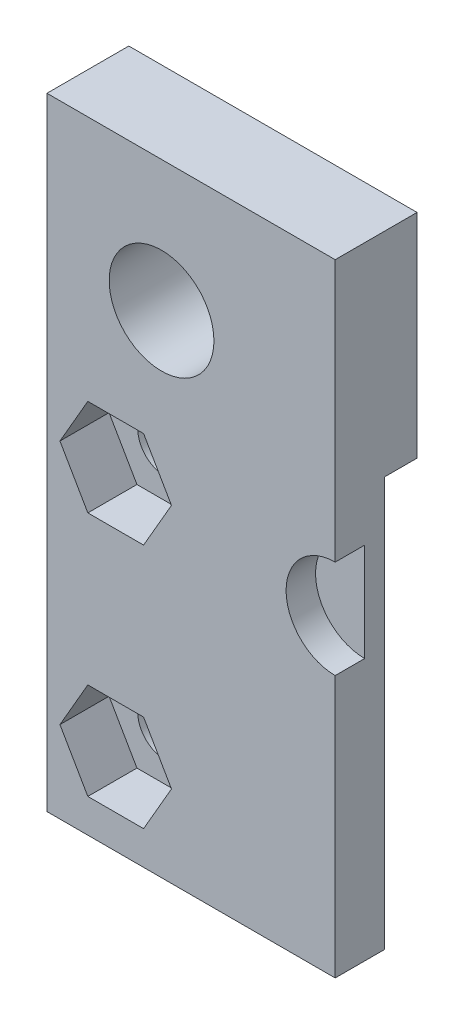
ISO-10303-21;
HEADER;
FILE_DESCRIPTION(('STEP AP214'),'2;1');
FILE_NAME('part.step','',(''),(''),'','','');
FILE_SCHEMA(('AUTOMOTIVE_DESIGN { 1 0 10303 214 1 1 1 1 }'));
ENDSEC;
DATA;
#1=APPLICATION_CONTEXT('core data for automotive mechanical design processes');
#2=APPLICATION_PROTOCOL_DEFINITION('international standard','automotive_design',2000,#1);
#3=PRODUCT_CONTEXT('',#1,'mechanical');
#4=PRODUCT('Part','Part','',(#3));
#5=PRODUCT_RELATED_PRODUCT_CATEGORY('part','',(#4));
#6=PRODUCT_DEFINITION_FORMATION('','',#4);
#7=PRODUCT_DEFINITION_CONTEXT('part definition',#1,'design');
#8=PRODUCT_DEFINITION('design','',#6,#7);
#9=PRODUCT_DEFINITION_SHAPE('','',#8);
#10=(LENGTH_UNIT() NAMED_UNIT(*) SI_UNIT(.MILLI.,.METRE.));
#11=(NAMED_UNIT(*) PLANE_ANGLE_UNIT() SI_UNIT($,.RADIAN.));
#12=(NAMED_UNIT(*) SI_UNIT($,.STERADIAN.) SOLID_ANGLE_UNIT());
#13=UNCERTAINTY_MEASURE_WITH_UNIT(LENGTH_MEASURE(1.E-05),#10,'distance_accuracy_value','');
#14=(GEOMETRIC_REPRESENTATION_CONTEXT(3) GLOBAL_UNCERTAINTY_ASSIGNED_CONTEXT((#13)) GLOBAL_UNIT_ASSIGNED_CONTEXT((#10,
#11,#12)) REPRESENTATION_CONTEXT('',''));
#15=CARTESIAN_POINT('',(0.,0.,0.));
#16=DIRECTION('',(0.,0.,1.));
#17=DIRECTION('',(1.,0.,0.));
#18=AXIS2_PLACEMENT_3D('',#15,#16,#17);
#19=CARTESIAN_POINT('',(0.,0.,5.));
#20=DIRECTION('',(0.,0.,-1.));
#21=DIRECTION('',(-1.,0.,0.));
#22=AXIS2_PLACEMENT_3D('',#19,#20,#21);
#23=PLANE('',#22);
#24=CARTESIAN_POINT('',(-2.41057900457741,5.83365910656025,5.));
#25=DIRECTION('',(0.,0.,1.));
#26=DIRECTION('',(1.,0.,0.));
#27=AXIS2_PLACEMENT_3D('',#24,#25,#26);
#28=CIRCLE('',#27,3.2);
#29=CARTESIAN_POINT('',(0.789420995422594,5.83365910656025,5.));
#30=VERTEX_POINT('',#29);
#31=EDGE_CURVE('E323',#30,#30,#28,.T.);
#32=ORIENTED_EDGE('',*,*,#31,.F.);
#33=EDGE_LOOP('',(#32));
#34=FACE_BOUND('',#33,.T.);
#35=DIRECTION('',(0.,1.,0.));
#36=VECTOR('',#35,1.);
#37=CARTESIAN_POINT('',(8.19602271322078,13.8336591065602,5.));
#38=LINE('',#37,#36);
#39=CARTESIAN_POINT('',(8.19602271322079,-24.1663408934398,5.));
#40=VERTEX_POINT('',#39);
#41=CARTESIAN_POINT('',(8.19602271322078,-8.16634089343975,5.));
#42=VERTEX_POINT('',#41);
#43=EDGE_CURVE('E337',#40,#42,#38,.T.);
#44=ORIENTED_EDGE('',*,*,#43,.T.);
#45=CARTESIAN_POINT('',(8.19602271322079,-5.16634089343975,5.));
#46=DIRECTION('',(0.,0.,1.));
#47=DIRECTION('',(1.,0.,0.));
#48=AXIS2_PLACEMENT_3D('',#45,#46,#47);
#49=CIRCLE('',#48,3.);
#50=CARTESIAN_POINT('',(8.19602271322079,-2.16634089343975,5.));
#51=VERTEX_POINT('',#50);
#52=EDGE_CURVE('E188',#51,#42,#49,.T.);
#53=ORIENTED_EDGE('',*,*,#52,.F.);
#54=CARTESIAN_POINT('',(8.19602271322078,13.8336591065602,5.));
#55=VERTEX_POINT('',#54);
#56=EDGE_CURVE('E193',#51,#55,#38,.T.);
#57=ORIENTED_EDGE('',*,*,#56,.T.);
#58=DIRECTION('',(-1.,0.,0.));
#59=VECTOR('',#58,1.);
#60=CARTESIAN_POINT('',(-9.41057900457741,13.8336591065602,5.));
#61=LINE('',#60,#59);
#62=CARTESIAN_POINT('',(-9.41057900457741,13.8336591065602,5.));
#63=VERTEX_POINT('',#62);
#64=EDGE_CURVE('E329',#55,#63,#61,.T.);
#65=ORIENTED_EDGE('',*,*,#64,.T.);
#66=DIRECTION('',(0.,-1.,0.));
#67=VECTOR('',#66,1.);
#68=CARTESIAN_POINT('',(-9.41057900457741,13.8336591065602,5.));
#69=LINE('',#68,#67);
#70=CARTESIAN_POINT('',(-9.4105790045774,-24.1663408934398,5.));
#71=VERTEX_POINT('',#70);
#72=EDGE_CURVE('E332',#63,#71,#69,.T.);
#73=ORIENTED_EDGE('',*,*,#72,.T.);
#74=DIRECTION('',(1.,0.,0.));
#75=VECTOR('',#74,1.);
#76=CARTESIAN_POINT('',(8.19602271322079,-24.1663408934398,5.));
#77=LINE('',#76,#75);
#78=EDGE_CURVE('E335',#71,#40,#77,.T.);
#79=ORIENTED_EDGE('',*,*,#78,.T.);
#80=EDGE_LOOP('',(#44,#53,#57,#65,#73,#79));
#81=FACE_BOUND('',#80,.T.);
#82=DIRECTION('',(-0.5,0.866025403784439,0.));
#83=VECTOR('',#82,1.);
#84=CARTESIAN_POINT('',(-3.15723783954135,-1.82283211655487,5.));
#85=LINE('',#84,#83);
#86=CARTESIAN_POINT('',(-1.80421241635861,-4.16634089343975,5.));
#87=VERTEX_POINT('',#86);
#88=CARTESIAN_POINT('',(-3.50739571046801,-1.21634089343975,5.));
#89=VERTEX_POINT('',#88);
#90=EDGE_CURVE('E196',#87,#89,#85,.T.);
#91=ORIENTED_EDGE('',*,*,#90,.F.);
#92=DIRECTION('',(0.5,0.866025403784439,0.));
#93=VECTOR('',#92,1.);
#94=CARTESIAN_POINT('',(0.450919215003431,-0.260338330165006,5.));
#95=LINE('',#94,#93);
#96=CARTESIAN_POINT('',(-3.50739571046801,-7.11634089343975,5.));
#97=VERTEX_POINT('',#96);
#98=EDGE_CURVE('E194',#97,#87,#95,.T.);
#99=ORIENTED_EDGE('',*,*,#98,.F.);
#100=DIRECTION('',(1.,0.,0.));
#101=VECTOR('',#100,1.);
#102=CARTESIAN_POINT('',(0.,-7.11634089343975,5.));
#103=LINE('',#102,#101);
#104=CARTESIAN_POINT('',(-6.9137622986868,-7.11634089343975,5.));
#105=VERTEX_POINT('',#104);
#106=EDGE_CURVE('E251',#105,#97,#103,.T.);
#107=ORIENTED_EDGE('',*,*,#106,.F.);
#108=DIRECTION('',(0.5,-0.866025403784439,0.));
#109=VECTOR('',#108,1.);
#110=CARTESIAN_POINT('',(-8.26678772186954,-4.77283211655487,5.));
#111=LINE('',#110,#109);
#112=CARTESIAN_POINT('',(-8.6169455927962,-4.16634089343975,5.));
#113=VERTEX_POINT('',#112);
#114=EDGE_CURVE('E278',#113,#105,#111,.T.);
#115=ORIENTED_EDGE('',*,*,#114,.F.);
#116=DIRECTION('',(-0.5,-0.866025403784438,0.));
#117=VECTOR('',#116,1.);
#118=CARTESIAN_POINT('',(-4.65863066732475,2.68966166983499,5.));
#119=LINE('',#118,#117);
#120=CARTESIAN_POINT('',(-6.9137622986868,-1.21634089343975,5.));
#121=VERTEX_POINT('',#120);
#122=EDGE_CURVE('E275',#121,#113,#119,.T.);
#123=ORIENTED_EDGE('',*,*,#122,.F.);
#124=DIRECTION('',(-1.,0.,0.));
#125=VECTOR('',#124,1.);
#126=CARTESIAN_POINT('',(0.,-1.21634089343975,5.));
#127=LINE('',#126,#125);
#128=EDGE_CURVE('E272',#89,#121,#127,.T.);
#129=ORIENTED_EDGE('',*,*,#128,.F.);
#130=EDGE_LOOP('',(#91,#99,#107,#115,#123,#129));
#131=FACE_BOUND('',#130,.T.);
#132=DIRECTION('',(-1.,0.,0.));
#133=VECTOR('',#132,1.);
#134=CARTESIAN_POINT('',(0.,-22.1163408934398,5.));
#135=LINE('',#134,#133);
#136=CARTESIAN_POINT('',(-3.507395710468,-22.1163408934398,5.));
#137=VERTEX_POINT('',#136);
#138=CARTESIAN_POINT('',(-6.91376229868679,-22.1163408934398,5.));
#139=VERTEX_POINT('',#138);
#140=EDGE_CURVE('E56',#137,#139,#135,.T.);
#141=ORIENTED_EDGE('',*,*,#140,.T.);
#142=DIRECTION('',(-0.5,0.866025403784439,0.));
#143=VECTOR('',#142,1.);
#144=CARTESIAN_POINT('',(-14.7619782502528,-8.52283211655487,5.));
#145=LINE('',#144,#143);
#146=CARTESIAN_POINT('',(-8.61694559279619,-19.1663408934397,5.));
#147=VERTEX_POINT('',#146);
#148=EDGE_CURVE('E205',#139,#147,#145,.T.);
#149=ORIENTED_EDGE('',*,*,#148,.T.);
#150=DIRECTION('',(0.5,0.866025403784439,0.));
#151=VECTOR('',#150,1.);
#152=CARTESIAN_POINT('',(1.83655986105853,-1.06033833016501,5.));
#153=LINE('',#152,#151);
#154=CARTESIAN_POINT('',(-6.9137622986868,-16.2163408934398,5.));
#155=VERTEX_POINT('',#154);
#156=EDGE_CURVE('E230',#147,#155,#153,.T.);
#157=ORIENTED_EDGE('',*,*,#156,.T.);
#158=DIRECTION('',(1.,0.,0.));
#159=VECTOR('',#158,1.);
#160=CARTESIAN_POINT('',(0.,-16.2163408934398,5.));
#161=LINE('',#160,#159);
#162=CARTESIAN_POINT('',(-3.507395710468,-16.2163408934398,5.));
#163=VERTEX_POINT('',#162);
#164=EDGE_CURVE('E227',#155,#163,#161,.T.);
#165=ORIENTED_EDGE('',*,*,#164,.T.);
#166=DIRECTION('',(0.5,-0.866025403784439,0.));
#167=VECTOR('',#166,1.);
#168=CARTESIAN_POINT('',(-9.65242836792464,-5.57283211655487,5.));
#169=LINE('',#168,#167);
#170=CARTESIAN_POINT('',(-1.80421241635861,-19.1663408934397,5.));
#171=VERTEX_POINT('',#170);
#172=EDGE_CURVE('E224',#163,#171,#169,.T.);
#173=ORIENTED_EDGE('',*,*,#172,.T.);
#174=DIRECTION('',(-0.5,-0.866025403784439,0.));
#175=VECTOR('',#174,1.);
#176=CARTESIAN_POINT('',(6.94610974338672,-4.010338330165,5.));
#177=LINE('',#176,#175);
#178=EDGE_CURVE('E220',#171,#137,#177,.T.);
#179=ORIENTED_EDGE('',*,*,#178,.T.);
#180=EDGE_LOOP('',(#141,#149,#157,#165,#173,#179));
#181=FACE_BOUND('',#180,.T.);
#182=ADVANCED_FACE('F34',(#34,#81,#131,#181),#23,.F.);
#183=CARTESIAN_POINT('',(-5.2105790045774,-4.16634089343975,5.));
#184=DIRECTION('',(0.,0.,-1.));
#185=DIRECTION('',(-1.,0.,0.));
#186=AXIS2_PLACEMENT_3D('',#183,#184,#185);
#187=CYLINDRICAL_SURFACE('',#186,1.65);
#188=CARTESIAN_POINT('',(-5.2105790045774,-4.16634089343975,0.));
#189=DIRECTION('',(0.,0.,1.));
#190=DIRECTION('',(1.,0.,0.));
#191=AXIS2_PLACEMENT_3D('',#188,#189,#190);
#192=CIRCLE('',#191,1.65);
#193=CARTESIAN_POINT('',(-3.5605790045774,-4.16634089343975,0.));
#194=VERTEX_POINT('',#193);
#195=EDGE_CURVE('E319',#194,#194,#192,.T.);
#196=ORIENTED_EDGE('',*,*,#195,.F.);
#197=EDGE_LOOP('',(#196));
#198=FACE_BOUND('',#197,.T.);
#199=CARTESIAN_POINT('',(-5.2105790045774,-4.16634089343975,2.));
#200=DIRECTION('',(0.,0.,1.));
#201=DIRECTION('',(1.,0.,0.));
#202=AXIS2_PLACEMENT_3D('',#199,#200,#201);
#203=CIRCLE('',#202,1.65);
#204=CARTESIAN_POINT('',(-3.5605790045774,-4.16634089343975,2.));
#205=VERTEX_POINT('',#204);
#206=EDGE_CURVE('E247',#205,#205,#203,.F.);
#207=ORIENTED_EDGE('',*,*,#206,.F.);
#208=EDGE_LOOP('',(#207));
#209=FACE_BOUND('',#208,.T.);
#210=ADVANCED_FACE('F397',(#198,#209),#187,.F.);
#211=CARTESIAN_POINT('',(-5.2105790045774,-19.1663408934397,5.));
#212=DIRECTION('',(0.,0.,-1.));
#213=DIRECTION('',(-1.,0.,0.));
#214=AXIS2_PLACEMENT_3D('',#211,#212,#213);
#215=CYLINDRICAL_SURFACE('',#214,1.65);
#216=CARTESIAN_POINT('',(-5.2105790045774,-19.1663408934397,0.));
#217=DIRECTION('',(0.,0.,1.));
#218=DIRECTION('',(-1.,0.,0.));
#219=AXIS2_PLACEMENT_3D('',#216,#217,#218);
#220=CIRCLE('',#219,1.65);
#221=CARTESIAN_POINT('',(-6.8605790045774,-19.1663408934397,0.));
#222=VERTEX_POINT('',#221);
#223=EDGE_CURVE('E312',#222,#222,#220,.T.);
#224=ORIENTED_EDGE('',*,*,#223,.F.);
#225=EDGE_LOOP('',(#224));
#226=FACE_BOUND('',#225,.T.);
#227=CARTESIAN_POINT('',(-5.2105790045774,-19.1663408934397,2.));
#228=DIRECTION('',(0.,0.,1.));
#229=DIRECTION('',(1.,0.,0.));
#230=AXIS2_PLACEMENT_3D('',#227,#228,#229);
#231=CIRCLE('',#230,1.65);
#232=CARTESIAN_POINT('',(-3.5605790045774,-19.1663408934397,2.));
#233=VERTEX_POINT('',#232);
#234=EDGE_CURVE('E215',#233,#233,#231,.F.);
#235=ORIENTED_EDGE('',*,*,#234,.F.);
#236=EDGE_LOOP('',(#235));
#237=FACE_BOUND('',#236,.T.);
#238=ADVANCED_FACE('F403',(#226,#237),#215,.F.);
#239=CARTESIAN_POINT('',(0.,0.,0.));
#240=DIRECTION('',(0.,0.,-1.));
#241=DIRECTION('',(-1.,0.,0.));
#242=AXIS2_PLACEMENT_3D('',#239,#240,#241);
#243=PLANE('',#242);
#244=DIRECTION('',(1.,0.,0.));
#245=VECTOR('',#244,1.);
#246=CARTESIAN_POINT('',(0.,0.833659106560258,0.));
#247=LINE('',#246,#245);
#248=CARTESIAN_POINT('',(4.19602271322078,0.833659106560255,0.));
#249=VERTEX_POINT('',#248);
#250=CARTESIAN_POINT('',(8.19602271322078,0.833659106560252,0.));
#251=VERTEX_POINT('',#250);
#252=EDGE_CURVE('E237',#249,#251,#247,.T.);
#253=ORIENTED_EDGE('',*,*,#252,.F.);
#254=DIRECTION('',(0.,1.,0.));
#255=VECTOR('',#254,1.);
#256=CARTESIAN_POINT('',(4.19602271322078,0.,0.));
#257=LINE('',#256,#255);
#258=CARTESIAN_POINT('',(4.19602271322079,-24.1663408934398,0.));
#259=VERTEX_POINT('',#258);
#260=EDGE_CURVE('E297',#259,#249,#257,.T.);
#261=ORIENTED_EDGE('',*,*,#260,.F.);
#262=DIRECTION('',(1.,0.,0.));
#263=VECTOR('',#262,1.);
#264=CARTESIAN_POINT('',(8.19602271322079,-24.1663408934398,0.));
#265=LINE('',#264,#263);
#266=CARTESIAN_POINT('',(-9.4105790045774,-24.1663408934398,0.));
#267=VERTEX_POINT('',#266);
#268=EDGE_CURVE('E345',#267,#259,#265,.T.);
#269=ORIENTED_EDGE('',*,*,#268,.F.);
#270=DIRECTION('',(0.,-1.,0.));
#271=VECTOR('',#270,1.);
#272=CARTESIAN_POINT('',(-9.41057900457741,13.8336591065602,0.));
#273=LINE('',#272,#271);
#274=CARTESIAN_POINT('',(-9.41057900457741,13.8336591065602,0.));
#275=VERTEX_POINT('',#274);
#276=EDGE_CURVE('E343',#275,#267,#273,.T.);
#277=ORIENTED_EDGE('',*,*,#276,.F.);
#278=DIRECTION('',(-1.,0.,0.));
#279=VECTOR('',#278,1.);
#280=CARTESIAN_POINT('',(-9.41057900457741,13.8336591065602,0.));
#281=LINE('',#280,#279);
#282=CARTESIAN_POINT('',(8.19602271322078,13.8336591065602,0.));
#283=VERTEX_POINT('',#282);
#284=EDGE_CURVE('E326',#283,#275,#281,.T.);
#285=ORIENTED_EDGE('',*,*,#284,.F.);
#286=DIRECTION('',(0.,1.,0.));
#287=VECTOR('',#286,1.);
#288=CARTESIAN_POINT('',(8.19602271322078,13.8336591065602,0.));
#289=LINE('',#288,#287);
#290=EDGE_CURVE('E333',#251,#283,#289,.T.);
#291=ORIENTED_EDGE('',*,*,#290,.F.);
#292=EDGE_LOOP('',(#253,#261,#269,#277,#285,#291));
#293=FACE_BOUND('',#292,.T.);
#294=ORIENTED_EDGE('',*,*,#195,.T.);
#295=EDGE_LOOP('',(#294));
#296=FACE_BOUND('',#295,.T.);
#297=CARTESIAN_POINT('',(-2.41057900457741,5.83365910656025,0.));
#298=DIRECTION('',(0.,0.,1.));
#299=DIRECTION('',(1.,0.,0.));
#300=AXIS2_PLACEMENT_3D('',#297,#298,#299);
#301=CIRCLE('',#300,3.2);
#302=CARTESIAN_POINT('',(0.789420995422594,5.83365910656025,0.));
#303=VERTEX_POINT('',#302);
#304=EDGE_CURVE('E322',#303,#303,#301,.T.);
#305=ORIENTED_EDGE('',*,*,#304,.T.);
#306=EDGE_LOOP('',(#305));
#307=FACE_BOUND('',#306,.T.);
#308=ORIENTED_EDGE('',*,*,#223,.T.);
#309=EDGE_LOOP('',(#308));
#310=FACE_BOUND('',#309,.T.);
#311=ADVANCED_FACE('F365',(#293,#296,#307,#310),#243,.T.);
#312=CARTESIAN_POINT('',(-9.41057900457741,13.8336591065602,5.));
#313=DIRECTION('',(0.,-1.,0.));
#314=DIRECTION('',(0.,0.,-1.));
#315=AXIS2_PLACEMENT_3D('',#312,#313,#314);
#316=PLANE('',#315);
#317=ORIENTED_EDGE('',*,*,#284,.T.);
#318=DIRECTION('',(0.,0.,-1.));
#319=VECTOR('',#318,1.);
#320=CARTESIAN_POINT('',(-9.41057900457741,13.8336591065602,5.));
#321=LINE('',#320,#319);
#322=EDGE_CURVE('E11',#63,#275,#321,.T.);
#323=ORIENTED_EDGE('',*,*,#322,.F.);
#324=ORIENTED_EDGE('',*,*,#64,.F.);
#325=DIRECTION('',(0.,0.,-1.));
#326=VECTOR('',#325,1.);
#327=CARTESIAN_POINT('',(8.19602271322078,13.8336591065602,5.));
#328=LINE('',#327,#326);
#329=EDGE_CURVE('E340',#55,#283,#328,.T.);
#330=ORIENTED_EDGE('',*,*,#329,.T.);
#331=EDGE_LOOP('',(#317,#323,#324,#330));
#332=FACE_BOUND('',#331,.T.);
#333=ADVANCED_FACE('F36',(#332),#316,.F.);
#334=CARTESIAN_POINT('',(-9.41057900457741,13.8336591065602,5.));
#335=DIRECTION('',(1.,0.,0.));
#336=DIRECTION('',(0.,1.,0.));
#337=AXIS2_PLACEMENT_3D('',#334,#335,#336);
#338=PLANE('',#337);
#339=ORIENTED_EDGE('',*,*,#276,.T.);
#340=DIRECTION('',(0.,0.,-1.));
#341=VECTOR('',#340,1.);
#342=CARTESIAN_POINT('',(-9.4105790045774,-24.1663408934398,5.));
#343=LINE('',#342,#341);
#344=EDGE_CURVE('E42',#71,#267,#343,.T.);
#345=ORIENTED_EDGE('',*,*,#344,.F.);
#346=ORIENTED_EDGE('',*,*,#72,.F.);
#347=ORIENTED_EDGE('',*,*,#322,.T.);
#348=EDGE_LOOP('',(#339,#345,#346,#347));
#349=FACE_BOUND('',#348,.T.);
#350=ADVANCED_FACE('F379',(#349),#338,.F.);
#351=CARTESIAN_POINT('',(8.19602271322079,-24.1663408934398,5.));
#352=DIRECTION('',(0.,1.,0.));
#353=DIRECTION('',(-1.,0.,0.));
#354=AXIS2_PLACEMENT_3D('',#351,#352,#353);
#355=PLANE('',#354);
#356=ORIENTED_EDGE('',*,*,#268,.T.);
#357=DIRECTION('',(0.,0.,-1.));
#358=VECTOR('',#357,1.);
#359=CARTESIAN_POINT('',(4.19602271322079,-24.1663408934398,2.));
#360=LINE('',#359,#358);
#361=CARTESIAN_POINT('',(4.19602271322079,-24.1663408934398,2.));
#362=VERTEX_POINT('',#361);
#363=EDGE_CURVE('E313',#362,#259,#360,.T.);
#364=ORIENTED_EDGE('',*,*,#363,.F.);
#365=DIRECTION('',(1.,0.,0.));
#366=VECTOR('',#365,1.);
#367=CARTESIAN_POINT('',(0.,-24.1663408934398,2.));
#368=LINE('',#367,#366);
#369=CARTESIAN_POINT('',(8.19602271322079,-24.1663408934398,2.));
#370=VERTEX_POINT('',#369);
#371=EDGE_CURVE('E300',#362,#370,#368,.T.);
#372=ORIENTED_EDGE('',*,*,#371,.T.);
#373=DIRECTION('',(0.,0.,-1.));
#374=VECTOR('',#373,1.);
#375=CARTESIAN_POINT('',(8.19602271322079,-24.1663408934398,5.));
#376=LINE('',#375,#374);
#377=EDGE_CURVE('E351',#40,#370,#376,.T.);
#378=ORIENTED_EDGE('',*,*,#377,.F.);
#379=ORIENTED_EDGE('',*,*,#78,.F.);
#380=ORIENTED_EDGE('',*,*,#344,.T.);
#381=EDGE_LOOP('',(#356,#364,#372,#378,#379,#380));
#382=FACE_BOUND('',#381,.T.);
#383=ADVANCED_FACE('F358',(#382),#355,.F.);
#384=CARTESIAN_POINT('',(8.19602271322078,13.8336591065602,5.));
#385=DIRECTION('',(-1.,0.,0.));
#386=DIRECTION('',(0.,-1.,0.));
#387=AXIS2_PLACEMENT_3D('',#384,#385,#386);
#388=PLANE('',#387);
#389=DIRECTION('',(0.,-1.,0.));
#390=VECTOR('',#389,1.);
#391=CARTESIAN_POINT('',(8.19602271322079,-2.16634089343975,3.2));
#392=LINE('',#391,#390);
#393=CARTESIAN_POINT('',(8.19602271322079,-2.16634089343975,3.2));
#394=VERTEX_POINT('',#393);
#395=CARTESIAN_POINT('',(8.19602271322078,-8.16634089343975,3.2));
#396=VERTEX_POINT('',#395);
#397=EDGE_CURVE('E177',#394,#396,#392,.T.);
#398=ORIENTED_EDGE('',*,*,#397,.T.);
#399=DIRECTION('',(0.,0.,1.));
#400=VECTOR('',#399,1.);
#401=CARTESIAN_POINT('',(8.19602271322078,-8.16634089343975,3.2));
#402=LINE('',#401,#400);
#403=EDGE_CURVE('E182',#396,#42,#402,.T.);
#404=ORIENTED_EDGE('',*,*,#403,.T.);
#405=ORIENTED_EDGE('',*,*,#43,.F.);
#406=ORIENTED_EDGE('',*,*,#377,.T.);
#407=DIRECTION('',(0.,1.,0.));
#408=VECTOR('',#407,1.);
#409=CARTESIAN_POINT('',(8.19602271322078,0.,2.));
#410=LINE('',#409,#408);
#411=CARTESIAN_POINT('',(8.19602271322078,0.833659106560256,2.));
#412=VERTEX_POINT('',#411);
#413=EDGE_CURVE('E296',#370,#412,#410,.T.);
#414=ORIENTED_EDGE('',*,*,#413,.T.);
#415=DIRECTION('',(0.,0.,-1.));
#416=VECTOR('',#415,1.);
#417=CARTESIAN_POINT('',(8.19602271322078,0.833659106560252,2.));
#418=LINE('',#417,#416);
#419=EDGE_CURVE('E306',#412,#251,#418,.T.);
#420=ORIENTED_EDGE('',*,*,#419,.T.);
#421=ORIENTED_EDGE('',*,*,#290,.T.);
#422=ORIENTED_EDGE('',*,*,#329,.F.);
#423=ORIENTED_EDGE('',*,*,#56,.F.);
#424=DIRECTION('',(0.,0.,1.));
#425=VECTOR('',#424,1.);
#426=CARTESIAN_POINT('',(8.19602271322079,-2.16634089343975,3.2));
#427=LINE('',#426,#425);
#428=EDGE_CURVE('E186',#394,#51,#427,.T.);
#429=ORIENTED_EDGE('',*,*,#428,.F.);
#430=EDGE_LOOP('',(#398,#404,#405,#406,#414,#420,#421,#422,#423,#429));
#431=FACE_BOUND('',#430,.T.);
#432=ADVANCED_FACE('F191',(#431),#388,.F.);
#433=CARTESIAN_POINT('',(-2.41057900457741,5.83365910656025,5.));
#434=DIRECTION('',(0.,0.,-1.));
#435=DIRECTION('',(-1.,0.,0.));
#436=AXIS2_PLACEMENT_3D('',#433,#434,#435);
#437=CYLINDRICAL_SURFACE('',#436,3.2);
#438=ORIENTED_EDGE('',*,*,#31,.T.);
#439=EDGE_LOOP('',(#438));
#440=FACE_BOUND('',#439,.T.);
#441=ORIENTED_EDGE('',*,*,#304,.F.);
#442=EDGE_LOOP('',(#441));
#443=FACE_BOUND('',#442,.T.);
#444=ADVANCED_FACE('F409',(#440,#443),#437,.F.);
#445=CARTESIAN_POINT('',(0.,0.833659106560258,2.));
#446=DIRECTION('',(0.,1.,0.));
#447=DIRECTION('',(-1.,0.,0.));
#448=AXIS2_PLACEMENT_3D('',#445,#446,#447);
#449=PLANE('',#448);
#450=ORIENTED_EDGE('',*,*,#252,.T.);
#451=ORIENTED_EDGE('',*,*,#419,.F.);
#452=DIRECTION('',(1.,0.,0.));
#453=VECTOR('',#452,1.);
#454=CARTESIAN_POINT('',(0.,0.833659106560258,2.));
#455=LINE('',#454,#453);
#456=CARTESIAN_POINT('',(4.19602271322078,0.833659106560255,2.));
#457=VERTEX_POINT('',#456);
#458=EDGE_CURVE('E294',#457,#412,#455,.T.);
#459=ORIENTED_EDGE('',*,*,#458,.F.);
#460=DIRECTION('',(0.,0.,-1.));
#461=VECTOR('',#460,1.);
#462=CARTESIAN_POINT('',(4.19602271322078,0.833659106560255,2.));
#463=LINE('',#462,#461);
#464=EDGE_CURVE('E310',#457,#249,#463,.T.);
#465=ORIENTED_EDGE('',*,*,#464,.T.);
#466=EDGE_LOOP('',(#450,#451,#459,#465));
#467=FACE_BOUND('',#466,.T.);
#468=ADVANCED_FACE('F383',(#467),#449,.F.);
#469=CARTESIAN_POINT('',(4.19602271322078,0.,2.));
#470=DIRECTION('',(-1.,0.,0.));
#471=DIRECTION('',(0.,-1.,0.));
#472=AXIS2_PLACEMENT_3D('',#469,#470,#471);
#473=PLANE('',#472);
#474=ORIENTED_EDGE('',*,*,#260,.T.);
#475=ORIENTED_EDGE('',*,*,#464,.F.);
#476=DIRECTION('',(0.,1.,0.));
#477=VECTOR('',#476,1.);
#478=CARTESIAN_POINT('',(4.19602271322078,0.,2.));
#479=LINE('',#478,#477);
#480=EDGE_CURVE('E303',#362,#457,#479,.T.);
#481=ORIENTED_EDGE('',*,*,#480,.F.);
#482=ORIENTED_EDGE('',*,*,#363,.T.);
#483=EDGE_LOOP('',(#474,#475,#481,#482));
#484=FACE_BOUND('',#483,.T.);
#485=ADVANCED_FACE('F370',(#484),#473,.F.);
#486=CARTESIAN_POINT('',(0.,0.,2.));
#487=DIRECTION('',(0.,0.,1.));
#488=DIRECTION('',(1.,0.,0.));
#489=AXIS2_PLACEMENT_3D('',#486,#487,#488);
#490=PLANE('',#489);
#491=ORIENTED_EDGE('',*,*,#458,.T.);
#492=ORIENTED_EDGE('',*,*,#413,.F.);
#493=ORIENTED_EDGE('',*,*,#371,.F.);
#494=ORIENTED_EDGE('',*,*,#480,.T.);
#495=EDGE_LOOP('',(#491,#492,#493,#494));
#496=FACE_BOUND('',#495,.T.);
#497=ADVANCED_FACE('F384',(#496),#490,.F.);
#498=CARTESIAN_POINT('',(0.,-22.1163408934398,2.));
#499=DIRECTION('',(0.,1.,0.));
#500=DIRECTION('',(0.,0.,1.));
#501=AXIS2_PLACEMENT_3D('',#498,#499,#500);
#502=PLANE('',#501);
#503=ORIENTED_EDGE('',*,*,#140,.F.);
#504=DIRECTION('',(0.,0.,1.));
#505=VECTOR('',#504,1.);
#506=CARTESIAN_POINT('',(-3.507395710468,-22.1163408934398,2.));
#507=LINE('',#506,#505);
#508=CARTESIAN_POINT('',(-3.507395710468,-22.1163408934398,2.));
#509=VERTEX_POINT('',#508);
#510=EDGE_CURVE('E218',#509,#137,#507,.T.);
#511=ORIENTED_EDGE('',*,*,#510,.F.);
#512=DIRECTION('',(-1.,0.,0.));
#513=VECTOR('',#512,1.);
#514=CARTESIAN_POINT('',(0.,-22.1163408934398,2.));
#515=LINE('',#514,#513);
#516=CARTESIAN_POINT('',(-6.91376229868679,-22.1163408934398,2.));
#517=VERTEX_POINT('',#516);
#518=EDGE_CURVE('E201',#509,#517,#515,.T.);
#519=ORIENTED_EDGE('',*,*,#518,.T.);
#520=DIRECTION('',(0.,0.,1.));
#521=VECTOR('',#520,1.);
#522=CARTESIAN_POINT('',(-6.91376229868679,-22.1163408934398,2.));
#523=LINE('',#522,#521);
#524=EDGE_CURVE('E235',#517,#139,#523,.T.);
#525=ORIENTED_EDGE('',*,*,#524,.T.);
#526=EDGE_LOOP('',(#503,#511,#519,#525));
#527=FACE_BOUND('',#526,.T.);
#528=ADVANCED_FACE('F386',(#527),#502,.T.);
#529=CARTESIAN_POINT('',(-14.7619782502528,-8.52283211655487,2.));
#530=DIRECTION('',(0.866025403784439,0.5,0.));
#531=DIRECTION('',(-0.5,0.866025403784439,0.));
#532=AXIS2_PLACEMENT_3D('',#529,#530,#531);
#533=PLANE('',#532);
#534=ORIENTED_EDGE('',*,*,#148,.F.);
#535=ORIENTED_EDGE('',*,*,#524,.F.);
#536=DIRECTION('',(-0.5,0.866025403784439,0.));
#537=VECTOR('',#536,1.);
#538=CARTESIAN_POINT('',(-14.7619782502528,-8.52283211655487,2.));
#539=LINE('',#538,#537);
#540=CARTESIAN_POINT('',(-8.61694559279619,-19.1663408934397,2.));
#541=VERTEX_POINT('',#540);
#542=EDGE_CURVE('E213',#517,#541,#539,.T.);
#543=ORIENTED_EDGE('',*,*,#542,.T.);
#544=DIRECTION('',(0.,0.,1.));
#545=VECTOR('',#544,1.);
#546=CARTESIAN_POINT('',(-8.61694559279619,-19.1663408934397,2.));
#547=LINE('',#546,#545);
#548=EDGE_CURVE('E238',#541,#147,#547,.T.);
#549=ORIENTED_EDGE('',*,*,#548,.T.);
#550=EDGE_LOOP('',(#534,#535,#543,#549));
#551=FACE_BOUND('',#550,.T.);
#552=ADVANCED_FACE('F392',(#551),#533,.T.);
#553=CARTESIAN_POINT('',(1.83655986105853,-1.06033833016501,2.));
#554=DIRECTION('',(0.866025403784439,-0.5,0.));
#555=DIRECTION('',(0.5,0.866025403784439,0.));
#556=AXIS2_PLACEMENT_3D('',#553,#554,#555);
#557=PLANE('',#556);
#558=ORIENTED_EDGE('',*,*,#156,.F.);
#559=ORIENTED_EDGE('',*,*,#548,.F.);
#560=DIRECTION('',(0.5,0.866025403784439,0.));
#561=VECTOR('',#560,1.);
#562=CARTESIAN_POINT('',(1.83655986105853,-1.06033833016501,2.));
#563=LINE('',#562,#561);
#564=CARTESIAN_POINT('',(-6.9137622986868,-16.2163408934398,2.));
#565=VERTEX_POINT('',#564);
#566=EDGE_CURVE('E211',#541,#565,#563,.T.);
#567=ORIENTED_EDGE('',*,*,#566,.T.);
#568=DIRECTION('',(0.,0.,1.));
#569=VECTOR('',#568,1.);
#570=CARTESIAN_POINT('',(-6.9137622986868,-16.2163408934398,2.));
#571=LINE('',#570,#569);
#572=EDGE_CURVE('E240',#565,#155,#571,.T.);
#573=ORIENTED_EDGE('',*,*,#572,.T.);
#574=EDGE_LOOP('',(#558,#559,#567,#573));
#575=FACE_BOUND('',#574,.T.);
#576=ADVANCED_FACE('F518',(#575),#557,.T.);
#577=CARTESIAN_POINT('',(0.,-16.2163408934398,2.));
#578=DIRECTION('',(0.,-1.,0.));
#579=DIRECTION('',(0.,0.,-1.));
#580=AXIS2_PLACEMENT_3D('',#577,#578,#579);
#581=PLANE('',#580);
#582=ORIENTED_EDGE('',*,*,#164,.F.);
#583=ORIENTED_EDGE('',*,*,#572,.F.);
#584=DIRECTION('',(1.,0.,0.));
#585=VECTOR('',#584,1.);
#586=CARTESIAN_POINT('',(0.,-16.2163408934398,2.));
#587=LINE('',#586,#585);
#588=CARTESIAN_POINT('',(-3.507395710468,-16.2163408934398,2.));
#589=VERTEX_POINT('',#588);
#590=EDGE_CURVE('E209',#565,#589,#587,.T.);
#591=ORIENTED_EDGE('',*,*,#590,.T.);
#592=DIRECTION('',(0.,0.,1.));
#593=VECTOR('',#592,1.);
#594=CARTESIAN_POINT('',(-3.507395710468,-16.2163408934398,2.));
#595=LINE('',#594,#593);
#596=EDGE_CURVE('E242',#589,#163,#595,.T.);
#597=ORIENTED_EDGE('',*,*,#596,.T.);
#598=EDGE_LOOP('',(#582,#583,#591,#597));
#599=FACE_BOUND('',#598,.T.);
#600=ADVANCED_FACE('F522',(#599),#581,.T.);
#601=CARTESIAN_POINT('',(-9.65242836792464,-5.57283211655487,2.));
#602=DIRECTION('',(-0.866025403784438,-0.5,0.));
#603=DIRECTION('',(0.5,-0.866025403784439,0.));
#604=AXIS2_PLACEMENT_3D('',#601,#602,#603);
#605=PLANE('',#604);
#606=ORIENTED_EDGE('',*,*,#172,.F.);
#607=ORIENTED_EDGE('',*,*,#596,.F.);
#608=DIRECTION('',(0.5,-0.866025403784439,0.));
#609=VECTOR('',#608,1.);
#610=CARTESIAN_POINT('',(-9.65242836792464,-5.57283211655487,2.));
#611=LINE('',#610,#609);
#612=CARTESIAN_POINT('',(-1.80421241635861,-19.1663408934397,2.));
#613=VERTEX_POINT('',#612);
#614=EDGE_CURVE('E207',#589,#613,#611,.T.);
#615=ORIENTED_EDGE('',*,*,#614,.T.);
#616=DIRECTION('',(0.,0.,1.));
#617=VECTOR('',#616,1.);
#618=CARTESIAN_POINT('',(-1.80421241635861,-19.1663408934397,2.));
#619=LINE('',#618,#617);
#620=EDGE_CURVE('E244',#613,#171,#619,.T.);
#621=ORIENTED_EDGE('',*,*,#620,.T.);
#622=EDGE_LOOP('',(#606,#607,#615,#621));
#623=FACE_BOUND('',#622,.T.);
#624=ADVANCED_FACE('F509',(#623),#605,.T.);
#625=CARTESIAN_POINT('',(6.94610974338672,-4.010338330165,2.));
#626=DIRECTION('',(-0.866025403784439,0.5,0.));
#627=DIRECTION('',(-0.5,-0.866025403784439,0.));
#628=AXIS2_PLACEMENT_3D('',#625,#626,#627);
#629=PLANE('',#628);
#630=ORIENTED_EDGE('',*,*,#178,.F.);
#631=ORIENTED_EDGE('',*,*,#620,.F.);
#632=DIRECTION('',(-0.5,-0.866025403784439,0.));
#633=VECTOR('',#632,1.);
#634=CARTESIAN_POINT('',(6.94610974338672,-4.010338330165,2.));
#635=LINE('',#634,#633);
#636=EDGE_CURVE('E204',#613,#509,#635,.T.);
#637=ORIENTED_EDGE('',*,*,#636,.T.);
#638=ORIENTED_EDGE('',*,*,#510,.T.);
#639=EDGE_LOOP('',(#630,#631,#637,#638));
#640=FACE_BOUND('',#639,.T.);
#641=ADVANCED_FACE('F500',(#640),#629,.T.);
#642=CARTESIAN_POINT('',(0.,0.,2.));
#643=DIRECTION('',(0.,0.,1.));
#644=DIRECTION('',(1.,0.,0.));
#645=AXIS2_PLACEMENT_3D('',#642,#643,#644);
#646=PLANE('',#645);
#647=ORIENTED_EDGE('',*,*,#518,.F.);
#648=ORIENTED_EDGE('',*,*,#636,.F.);
#649=ORIENTED_EDGE('',*,*,#614,.F.);
#650=ORIENTED_EDGE('',*,*,#590,.F.);
#651=ORIENTED_EDGE('',*,*,#566,.F.);
#652=ORIENTED_EDGE('',*,*,#542,.F.);
#653=EDGE_LOOP('',(#647,#648,#649,#650,#651,#652));
#654=FACE_BOUND('',#653,.T.);
#655=ORIENTED_EDGE('',*,*,#234,.T.);
#656=EDGE_LOOP('',(#655));
#657=FACE_BOUND('',#656,.T.);
#658=ADVANCED_FACE('F497',(#654,#657),#646,.T.);
#659=CARTESIAN_POINT('',(0.450919215003431,-0.260338330165006,2.));
#660=DIRECTION('',(0.866025403784438,-0.5,0.));
#661=DIRECTION('',(0.5,0.866025403784439,0.));
#662=AXIS2_PLACEMENT_3D('',#659,#660,#661);
#663=PLANE('',#662);
#664=ORIENTED_EDGE('',*,*,#98,.T.);
#665=DIRECTION('',(0.,0.,1.));
#666=VECTOR('',#665,1.);
#667=CARTESIAN_POINT('',(-1.80421241635861,-4.16634089343975,2.));
#668=LINE('',#667,#666);
#669=CARTESIAN_POINT('',(-1.80421241635861,-4.16634089343975,2.));
#670=VERTEX_POINT('',#669);
#671=EDGE_CURVE('E268',#670,#87,#668,.T.);
#672=ORIENTED_EDGE('',*,*,#671,.F.);
#673=DIRECTION('',(0.5,0.866025403784439,0.));
#674=VECTOR('',#673,1.);
#675=CARTESIAN_POINT('',(0.450919215003431,-0.260338330165006,2.));
#676=LINE('',#675,#674);
#677=CARTESIAN_POINT('',(-3.50739571046801,-7.11634089343975,2.));
#678=VERTEX_POINT('',#677);
#679=EDGE_CURVE('E250',#678,#670,#676,.T.);
#680=ORIENTED_EDGE('',*,*,#679,.F.);
#681=DIRECTION('',(0.,0.,1.));
#682=VECTOR('',#681,1.);
#683=CARTESIAN_POINT('',(-3.50739571046801,-7.11634089343975,2.));
#684=LINE('',#683,#682);
#685=EDGE_CURVE('E221',#678,#97,#684,.T.);
#686=ORIENTED_EDGE('',*,*,#685,.T.);
#687=EDGE_LOOP('',(#664,#672,#680,#686));
#688=FACE_BOUND('',#687,.T.);
#689=ADVANCED_FACE('F499',(#688),#663,.F.);
#690=CARTESIAN_POINT('',(0.,-7.11634089343975,2.));
#691=DIRECTION('',(0.,-1.,0.));
#692=DIRECTION('',(0.,0.,-1.));
#693=AXIS2_PLACEMENT_3D('',#690,#691,#692);
#694=PLANE('',#693);
#695=ORIENTED_EDGE('',*,*,#106,.T.);
#696=ORIENTED_EDGE('',*,*,#685,.F.);
#697=DIRECTION('',(1.,0.,0.));
#698=VECTOR('',#697,1.);
#699=CARTESIAN_POINT('',(0.,-7.11634089343975,2.));
#700=LINE('',#699,#698);
#701=CARTESIAN_POINT('',(-6.9137622986868,-7.11634089343975,2.));
#702=VERTEX_POINT('',#701);
#703=EDGE_CURVE('E266',#702,#678,#700,.T.);
#704=ORIENTED_EDGE('',*,*,#703,.F.);
#705=DIRECTION('',(0.,0.,1.));
#706=VECTOR('',#705,1.);
#707=CARTESIAN_POINT('',(-6.9137622986868,-7.11634089343975,2.));
#708=LINE('',#707,#706);
#709=EDGE_CURVE('E284',#702,#105,#708,.T.);
#710=ORIENTED_EDGE('',*,*,#709,.T.);
#711=EDGE_LOOP('',(#695,#696,#704,#710));
#712=FACE_BOUND('',#711,.T.);
#713=ADVANCED_FACE('F507',(#712),#694,.F.);
#714=CARTESIAN_POINT('',(-8.26678772186954,-4.77283211655487,2.));
#715=DIRECTION('',(-0.866025403784438,-0.5,0.));
#716=DIRECTION('',(0.5,-0.866025403784439,0.));
#717=AXIS2_PLACEMENT_3D('',#714,#715,#716);
#718=PLANE('',#717);
#719=ORIENTED_EDGE('',*,*,#114,.T.);
#720=ORIENTED_EDGE('',*,*,#709,.F.);
#721=DIRECTION('',(0.5,-0.866025403784439,0.));
#722=VECTOR('',#721,1.);
#723=CARTESIAN_POINT('',(-8.26678772186954,-4.77283211655487,2.));
#724=LINE('',#723,#722);
#725=CARTESIAN_POINT('',(-8.6169455927962,-4.16634089343975,2.));
#726=VERTEX_POINT('',#725);
#727=EDGE_CURVE('E263',#726,#702,#724,.T.);
#728=ORIENTED_EDGE('',*,*,#727,.F.);
#729=DIRECTION('',(0.,0.,1.));
#730=VECTOR('',#729,1.);
#731=CARTESIAN_POINT('',(-8.6169455927962,-4.16634089343975,2.));
#732=LINE('',#731,#730);
#733=EDGE_CURVE('E286',#726,#113,#732,.T.);
#734=ORIENTED_EDGE('',*,*,#733,.T.);
#735=EDGE_LOOP('',(#719,#720,#728,#734));
#736=FACE_BOUND('',#735,.T.);
#737=ADVANCED_FACE('F537',(#736),#718,.F.);
#738=CARTESIAN_POINT('',(-4.65863066732475,2.68966166983499,2.));
#739=DIRECTION('',(-0.866025403784438,0.500000000000001,0.));
#740=DIRECTION('',(-0.500000000000001,-0.866025403784438,0.));
#741=AXIS2_PLACEMENT_3D('',#738,#739,#740);
#742=PLANE('',#741);
#743=ORIENTED_EDGE('',*,*,#122,.T.);
#744=ORIENTED_EDGE('',*,*,#733,.F.);
#745=DIRECTION('',(-0.5,-0.866025403784438,0.));
#746=VECTOR('',#745,1.);
#747=CARTESIAN_POINT('',(-4.65863066732475,2.68966166983499,2.));
#748=LINE('',#747,#746);
#749=CARTESIAN_POINT('',(-6.9137622986868,-1.21634089343975,2.));
#750=VERTEX_POINT('',#749);
#751=EDGE_CURVE('E260',#750,#726,#748,.T.);
#752=ORIENTED_EDGE('',*,*,#751,.F.);
#753=DIRECTION('',(0.,0.,1.));
#754=VECTOR('',#753,1.);
#755=CARTESIAN_POINT('',(-6.9137622986868,-1.21634089343975,2.));
#756=LINE('',#755,#754);
#757=EDGE_CURVE('E288',#750,#121,#756,.T.);
#758=ORIENTED_EDGE('',*,*,#757,.T.);
#759=EDGE_LOOP('',(#743,#744,#752,#758));
#760=FACE_BOUND('',#759,.T.);
#761=ADVANCED_FACE('F541',(#760),#742,.F.);
#762=CARTESIAN_POINT('',(0.,-1.21634089343975,2.));
#763=DIRECTION('',(0.,1.,0.));
#764=DIRECTION('',(-1.,0.,0.));
#765=AXIS2_PLACEMENT_3D('',#762,#763,#764);
#766=PLANE('',#765);
#767=ORIENTED_EDGE('',*,*,#128,.T.);
#768=ORIENTED_EDGE('',*,*,#757,.F.);
#769=DIRECTION('',(-1.,0.,0.));
#770=VECTOR('',#769,1.);
#771=CARTESIAN_POINT('',(0.,-1.21634089343975,2.));
#772=LINE('',#771,#770);
#773=CARTESIAN_POINT('',(-3.50739571046801,-1.21634089343975,2.));
#774=VERTEX_POINT('',#773);
#775=EDGE_CURVE('E257',#774,#750,#772,.T.);
#776=ORIENTED_EDGE('',*,*,#775,.F.);
#777=DIRECTION('',(0.,0.,1.));
#778=VECTOR('',#777,1.);
#779=CARTESIAN_POINT('',(-3.50739571046801,-1.21634089343975,2.));
#780=LINE('',#779,#778);
#781=EDGE_CURVE('E290',#774,#89,#780,.T.);
#782=ORIENTED_EDGE('',*,*,#781,.T.);
#783=EDGE_LOOP('',(#767,#768,#776,#782));
#784=FACE_BOUND('',#783,.T.);
#785=ADVANCED_FACE('F545',(#784),#766,.F.);
#786=CARTESIAN_POINT('',(-3.15723783954135,-1.82283211655487,2.));
#787=DIRECTION('',(0.866025403784439,0.5,0.));
#788=DIRECTION('',(-0.5,0.866025403784439,0.));
#789=AXIS2_PLACEMENT_3D('',#786,#787,#788);
#790=PLANE('',#789);
#791=ORIENTED_EDGE('',*,*,#90,.T.);
#792=ORIENTED_EDGE('',*,*,#781,.F.);
#793=DIRECTION('',(-0.5,0.866025403784439,0.));
#794=VECTOR('',#793,1.);
#795=CARTESIAN_POINT('',(-3.15723783954135,-1.82283211655487,2.));
#796=LINE('',#795,#794);
#797=EDGE_CURVE('E254',#670,#774,#796,.T.);
#798=ORIENTED_EDGE('',*,*,#797,.F.);
#799=ORIENTED_EDGE('',*,*,#671,.T.);
#800=EDGE_LOOP('',(#791,#792,#798,#799));
#801=FACE_BOUND('',#800,.T.);
#802=ADVANCED_FACE('F533',(#801),#790,.F.);
#803=CARTESIAN_POINT('',(0.,0.,2.));
#804=DIRECTION('',(0.,0.,1.));
#805=DIRECTION('',(1.,0.,0.));
#806=AXIS2_PLACEMENT_3D('',#803,#804,#805);
#807=PLANE('',#806);
#808=ORIENTED_EDGE('',*,*,#206,.T.);
#809=EDGE_LOOP('',(#808));
#810=FACE_BOUND('',#809,.T.);
#811=ORIENTED_EDGE('',*,*,#679,.T.);
#812=ORIENTED_EDGE('',*,*,#797,.T.);
#813=ORIENTED_EDGE('',*,*,#775,.T.);
#814=ORIENTED_EDGE('',*,*,#751,.T.);
#815=ORIENTED_EDGE('',*,*,#727,.T.);
#816=ORIENTED_EDGE('',*,*,#703,.T.);
#817=EDGE_LOOP('',(#811,#812,#813,#814,#815,#816));
#818=FACE_BOUND('',#817,.T.);
#819=ADVANCED_FACE('F530',(#810,#818),#807,.T.);
#820=CARTESIAN_POINT('',(8.19602271322079,-5.16634089343975,3.2));
#821=DIRECTION('',(0.,0.,1.));
#822=DIRECTION('',(1.,0.,0.));
#823=AXIS2_PLACEMENT_3D('',#820,#821,#822);
#824=CYLINDRICAL_SURFACE('',#823,3.);
#825=ORIENTED_EDGE('',*,*,#52,.T.);
#826=ORIENTED_EDGE('',*,*,#403,.F.);
#827=CARTESIAN_POINT('',(8.19602271322079,-5.16634089343975,3.2));
#828=DIRECTION('',(0.,0.,1.));
#829=DIRECTION('',(1.,0.,0.));
#830=AXIS2_PLACEMENT_3D('',#827,#828,#829);
#831=CIRCLE('',#830,3.);
#832=EDGE_CURVE('E48',#394,#396,#831,.T.);
#833=ORIENTED_EDGE('',*,*,#832,.F.);
#834=ORIENTED_EDGE('',*,*,#428,.T.);
#835=EDGE_LOOP('',(#825,#826,#833,#834));
#836=FACE_BOUND('',#835,.T.);
#837=ADVANCED_FACE('F185',(#836),#824,.F.);
#838=CARTESIAN_POINT('',(8.19602271322079,-5.16634089343975,3.2));
#839=DIRECTION('',(0.,0.,1.));
#840=DIRECTION('',(1.,0.,0.));
#841=AXIS2_PLACEMENT_3D('',#838,#839,#840);
#842=PLANE('',#841);
#843=ORIENTED_EDGE('',*,*,#832,.T.);
#844=ORIENTED_EDGE('',*,*,#397,.F.);
#845=EDGE_LOOP('',(#843,#844));
#846=FACE_BOUND('',#845,.T.);
#847=ADVANCED_FACE('F178',(#846),#842,.T.);
#848=CLOSED_SHELL('',(#182,#210,#238,#311,#333,#350,#383,#432,#444,#468,#485,#497,#528,#552,
#576,#600,#624,#641,#658,#689,#713,#737,#761,#785,#802,#819,#837,#847));
#849=MANIFOLD_SOLID_BREP('B2',#848);
#850=ADVANCED_BREP_SHAPE_REPRESENTATION('',(#18,#849),#14);
#851=SHAPE_DEFINITION_REPRESENTATION(#9,#850);
ENDSEC;
END-ISO-10303-21;
